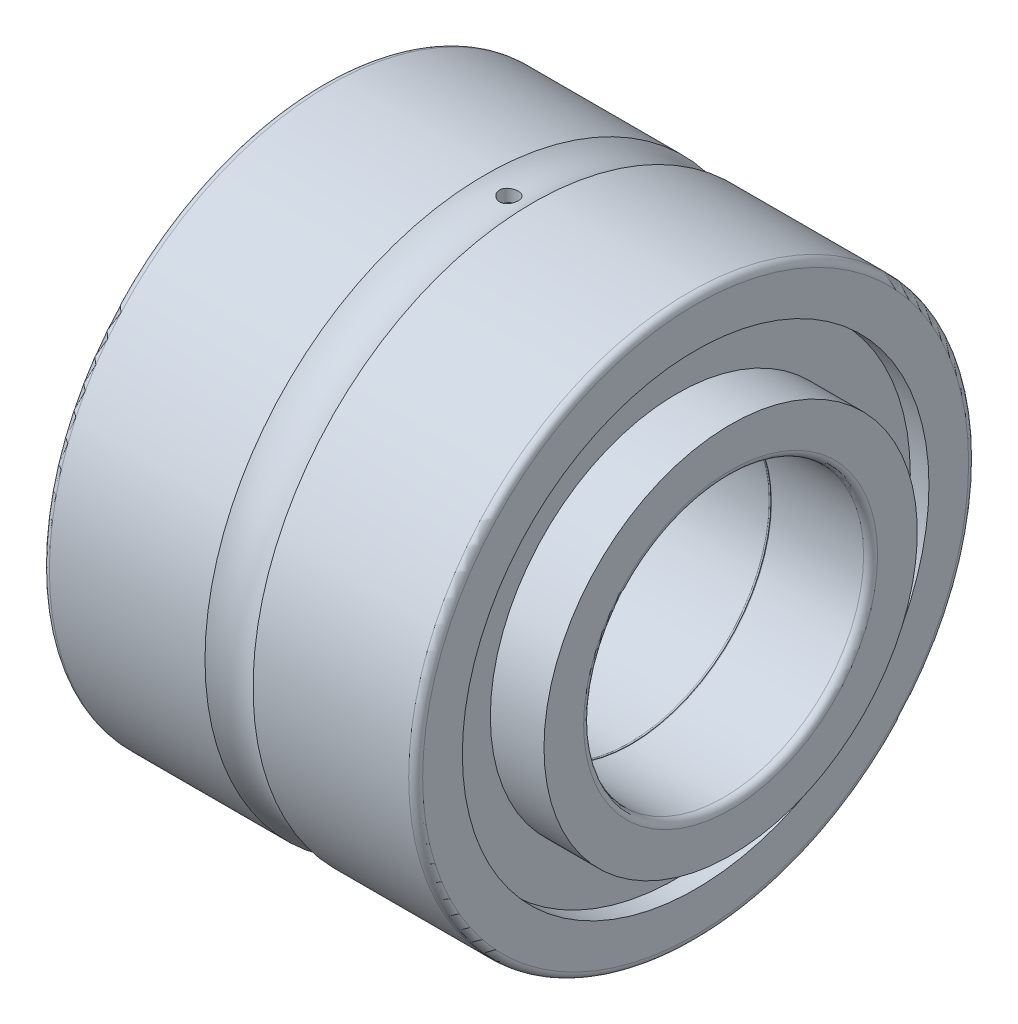
ISO-10303-21;
HEADER;
FILE_DESCRIPTION(('STEP AP214'),'2;1');
FILE_NAME('part.step','',(''),(''),'','','');
FILE_SCHEMA(('AUTOMOTIVE_DESIGN { 1 0 10303 214 1 1 1 1 }'));
ENDSEC;
DATA;
#1=APPLICATION_CONTEXT('core data for automotive mechanical design processes');
#2=APPLICATION_PROTOCOL_DEFINITION('international standard','automotive_design',2000,#1);
#3=PRODUCT_CONTEXT('',#1,'mechanical');
#4=PRODUCT('Part','Part','',(#3));
#5=PRODUCT_RELATED_PRODUCT_CATEGORY('part','',(#4));
#6=PRODUCT_DEFINITION_FORMATION('','',#4);
#7=PRODUCT_DEFINITION_CONTEXT('part definition',#1,'design');
#8=PRODUCT_DEFINITION('design','',#6,#7);
#9=PRODUCT_DEFINITION_SHAPE('','',#8);
#10=(LENGTH_UNIT() NAMED_UNIT(*) SI_UNIT(.MILLI.,.METRE.));
#11=(NAMED_UNIT(*) PLANE_ANGLE_UNIT() SI_UNIT($,.RADIAN.));
#12=(NAMED_UNIT(*) SI_UNIT($,.STERADIAN.) SOLID_ANGLE_UNIT());
#13=UNCERTAINTY_MEASURE_WITH_UNIT(LENGTH_MEASURE(1.E-05),#10,'distance_accuracy_value','');
#14=(GEOMETRIC_REPRESENTATION_CONTEXT(3) GLOBAL_UNCERTAINTY_ASSIGNED_CONTEXT((#13)) GLOBAL_UNIT_ASSIGNED_CONTEXT((#10,
#11,#12)) REPRESENTATION_CONTEXT('',''));
#15=CARTESIAN_POINT('',(0.,0.,0.));
#16=DIRECTION('',(0.,0.,1.));
#17=DIRECTION('',(1.,0.,0.));
#18=AXIS2_PLACEMENT_3D('',#15,#16,#17);
#19=CARTESIAN_POINT('',(13.25,0.,0.));
#20=DIRECTION('',(1.,0.,0.));
#21=DIRECTION('',(0.,0.,-1.));
#22=AXIS2_PLACEMENT_3D('',#19,#20,#21);
#23=TOROIDAL_SURFACE('',#22,6.05,0.0500000000000025);
#24=CARTESIAN_POINT('',(13.1999999999999,0.,0.));
#25=DIRECTION('',(1.,0.,0.));
#26=DIRECTION('',(0.,0.,-1.));
#27=AXIS2_PLACEMENT_3D('',#24,#25,#26);
#28=CIRCLE('',#27,6.05000007699655);
#29=CARTESIAN_POINT('',(13.1999999999999,0.,-6.05000007699655));
#30=VERTEX_POINT('',#29);
#31=EDGE_CURVE('E222',#30,#30,#28,.T.);
#32=ORIENTED_EDGE('',*,*,#31,.F.);
#33=EDGE_LOOP('',(#32));
#34=FACE_BOUND('',#33,.T.);
#35=CARTESIAN_POINT('',(13.25,0.,0.));
#36=DIRECTION('',(-1.,0.,0.));
#37=DIRECTION('',(0.,0.,1.));
#38=AXIS2_PLACEMENT_3D('',#35,#36,#37);
#39=CIRCLE('',#38,6.);
#40=CARTESIAN_POINT('',(13.25,0.,6.));
#41=VERTEX_POINT('',#40);
#42=EDGE_CURVE('E219',#41,#41,#39,.F.);
#43=ORIENTED_EDGE('',*,*,#42,.T.);
#44=EDGE_LOOP('',(#43));
#45=FACE_BOUND('',#44,.T.);
#46=ADVANCED_FACE('F17',(#34,#45),#23,.T.);
#47=CARTESIAN_POINT('',(16.,0.,0.));
#48=DIRECTION('',(-1.,0.,0.));
#49=DIRECTION('',(0.,0.,1.));
#50=AXIS2_PLACEMENT_3D('',#47,#48,#49);
#51=CYLINDRICAL_SURFACE('',#50,6.);
#52=ORIENTED_EDGE('',*,*,#42,.F.);
#53=EDGE_LOOP('',(#52));
#54=FACE_BOUND('',#53,.T.);
#55=CARTESIAN_POINT('',(17.2,0.,0.));
#56=DIRECTION('',(1.,0.,0.));
#57=DIRECTION('',(0.,0.,-1.));
#58=AXIS2_PLACEMENT_3D('',#55,#56,#57);
#59=CIRCLE('',#58,6.);
#60=CARTESIAN_POINT('',(17.2,0.,-6.));
#61=VERTEX_POINT('',#60);
#62=EDGE_CURVE('E227',#61,#61,#59,.F.);
#63=ORIENTED_EDGE('',*,*,#62,.F.);
#64=EDGE_LOOP('',(#63));
#65=FACE_BOUND('',#64,.T.);
#66=ADVANCED_FACE('F238',(#54,#65),#51,.F.);
#67=CARTESIAN_POINT('',(13.15,0.,0.));
#68=DIRECTION('',(1.,0.,0.));
#69=DIRECTION('',(0.,0.,-1.));
#70=AXIS2_PLACEMENT_3D('',#67,#68,#69);
#71=TOROIDAL_SURFACE('',#70,6.05,0.0500000000000014);
#72=CARTESIAN_POINT('',(13.15,0.,0.));
#73=DIRECTION('',(-1.,0.,0.));
#74=DIRECTION('',(0.,0.,1.));
#75=AXIS2_PLACEMENT_3D('',#72,#73,#74);
#76=CIRCLE('',#75,6.);
#77=CARTESIAN_POINT('',(13.15,0.,6.));
#78=VERTEX_POINT('',#77);
#79=EDGE_CURVE('E307',#78,#78,#76,.T.);
#80=ORIENTED_EDGE('',*,*,#79,.T.);
#81=EDGE_LOOP('',(#80));
#82=FACE_BOUND('',#81,.T.);
#83=ORIENTED_EDGE('',*,*,#31,.T.);
#84=EDGE_LOOP('',(#83));
#85=FACE_BOUND('',#84,.T.);
#86=ADVANCED_FACE('F235',(#82,#85),#71,.T.);
#87=CARTESIAN_POINT('',(17.2,0.,0.));
#88=DIRECTION('',(1.,0.,0.));
#89=DIRECTION('',(0.,0.,-1.));
#90=AXIS2_PLACEMENT_3D('',#87,#88,#89);
#91=TOROIDAL_SURFACE('',#90,6.3,0.300000000000001);
#92=ORIENTED_EDGE('',*,*,#62,.T.);
#93=EDGE_LOOP('',(#92));
#94=FACE_BOUND('',#93,.T.);
#95=CARTESIAN_POINT('',(17.5,0.,0.));
#96=DIRECTION('',(1.,0.,0.));
#97=DIRECTION('',(0.,0.,-1.));
#98=AXIS2_PLACEMENT_3D('',#95,#96,#97);
#99=CIRCLE('',#98,6.3);
#100=CARTESIAN_POINT('',(17.5,0.,-6.3));
#101=VERTEX_POINT('',#100);
#102=EDGE_CURVE('E305',#101,#101,#99,.F.);
#103=ORIENTED_EDGE('',*,*,#102,.F.);
#104=EDGE_LOOP('',(#103));
#105=FACE_BOUND('',#104,.T.);
#106=ADVANCED_FACE('F237',(#94,#105),#91,.T.);
#107=CARTESIAN_POINT('',(16.,0.,0.));
#108=DIRECTION('',(-1.,0.,0.));
#109=DIRECTION('',(0.,0.,1.));
#110=AXIS2_PLACEMENT_3D('',#107,#108,#109);
#111=CYLINDRICAL_SURFACE('',#110,6.);
#112=CARTESIAN_POINT('',(0.300000000000002,0.,0.));
#113=DIRECTION('',(1.,0.,0.));
#114=DIRECTION('',(0.,0.,-1.));
#115=AXIS2_PLACEMENT_3D('',#112,#113,#114);
#116=CIRCLE('',#115,6.);
#117=CARTESIAN_POINT('',(0.300000000000002,0.,-6.));
#118=VERTEX_POINT('',#117);
#119=EDGE_CURVE('E45',#118,#118,#116,.T.);
#120=ORIENTED_EDGE('',*,*,#119,.F.);
#121=EDGE_LOOP('',(#120));
#122=FACE_BOUND('',#121,.T.);
#123=ORIENTED_EDGE('',*,*,#79,.F.);
#124=EDGE_LOOP('',(#123));
#125=FACE_BOUND('',#124,.T.);
#126=ADVANCED_FACE('F325',(#122,#125),#111,.F.);
#127=CARTESIAN_POINT('',(17.5,6.3,0.));
#128=DIRECTION('',(1.,0.,0.));
#129=DIRECTION('',(0.,0.,-1.));
#130=AXIS2_PLACEMENT_3D('',#127,#128,#129);
#131=PLANE('',#130);
#132=ORIENTED_EDGE('',*,*,#102,.T.);
#133=EDGE_LOOP('',(#132));
#134=FACE_BOUND('',#133,.T.);
#135=CARTESIAN_POINT('',(17.5,0.,0.));
#136=DIRECTION('',(-1.,0.,0.));
#137=DIRECTION('',(0.,0.,1.));
#138=AXIS2_PLACEMENT_3D('',#135,#136,#137);
#139=CIRCLE('',#138,8.);
#140=CARTESIAN_POINT('',(17.5,0.,8.));
#141=VERTEX_POINT('',#140);
#142=EDGE_CURVE('E21',#141,#141,#139,.T.);
#143=ORIENTED_EDGE('',*,*,#142,.F.);
#144=EDGE_LOOP('',(#143));
#145=FACE_BOUND('',#144,.T.);
#146=ADVANCED_FACE('F70',(#134,#145),#131,.T.);
#147=CARTESIAN_POINT('',(0.300000000000002,0.,0.));
#148=DIRECTION('',(1.,0.,0.));
#149=DIRECTION('',(0.,0.,-1.));
#150=AXIS2_PLACEMENT_3D('',#147,#148,#149);
#151=TOROIDAL_SURFACE('',#150,6.3,0.300000000000002);
#152=CARTESIAN_POINT('',(0.,0.,0.));
#153=DIRECTION('',(-1.,0.,0.));
#154=DIRECTION('',(0.,0.,-1.));
#155=AXIS2_PLACEMENT_3D('',#152,#153,#154);
#156=CIRCLE('',#155,6.3);
#157=CARTESIAN_POINT('',(0.,0.,-6.3));
#158=VERTEX_POINT('',#157);
#159=EDGE_CURVE('E52',#158,#158,#156,.F.);
#160=ORIENTED_EDGE('',*,*,#159,.F.);
#161=EDGE_LOOP('',(#160));
#162=FACE_BOUND('',#161,.T.);
#163=ORIENTED_EDGE('',*,*,#119,.T.);
#164=EDGE_LOOP('',(#163));
#165=FACE_BOUND('',#164,.T.);
#166=ADVANCED_FACE('F59',(#162,#165),#151,.T.);
#167=CARTESIAN_POINT('',(16.,0.,0.));
#168=DIRECTION('',(-1.,0.,0.));
#169=DIRECTION('',(0.,0.,1.));
#170=AXIS2_PLACEMENT_3D('',#167,#168,#169);
#171=CYLINDRICAL_SURFACE('',#170,8.);
#172=ORIENTED_EDGE('',*,*,#142,.T.);
#173=EDGE_LOOP('',(#172));
#174=FACE_BOUND('',#173,.T.);
#175=CARTESIAN_POINT('',(15.2,0.,0.));
#176=DIRECTION('',(-1.,0.,0.));
#177=DIRECTION('',(0.,0.,1.));
#178=AXIS2_PLACEMENT_3D('',#175,#176,#177);
#179=CIRCLE('',#178,8.);
#180=CARTESIAN_POINT('',(15.2,0.,8.));
#181=VERTEX_POINT('',#180);
#182=EDGE_CURVE('E347',#181,#181,#179,.T.);
#183=ORIENTED_EDGE('',*,*,#182,.F.);
#184=EDGE_LOOP('',(#183));
#185=FACE_BOUND('',#184,.T.);
#186=ADVANCED_FACE('F69',(#174,#185),#171,.T.);
#187=CARTESIAN_POINT('',(0.,8.,0.));
#188=DIRECTION('',(-1.,0.,0.));
#189=DIRECTION('',(0.,0.,1.));
#190=AXIS2_PLACEMENT_3D('',#187,#188,#189);
#191=PLANE('',#190);
#192=CARTESIAN_POINT('',(0.,0.,0.));
#193=DIRECTION('',(-1.,0.,0.));
#194=DIRECTION('',(0.,0.,1.));
#195=AXIS2_PLACEMENT_3D('',#192,#193,#194);
#196=CIRCLE('',#195,8.);
#197=CARTESIAN_POINT('',(0.,0.,8.));
#198=VERTEX_POINT('',#197);
#199=EDGE_CURVE('E351',#198,#198,#196,.F.);
#200=ORIENTED_EDGE('',*,*,#199,.F.);
#201=EDGE_LOOP('',(#200));
#202=FACE_BOUND('',#201,.T.);
#203=ORIENTED_EDGE('',*,*,#159,.T.);
#204=EDGE_LOOP('',(#203));
#205=FACE_BOUND('',#204,.T.);
#206=ADVANCED_FACE('F81',(#202,#205),#191,.T.);
#207=CARTESIAN_POINT('',(15.2,8.,0.));
#208=DIRECTION('',(1.,0.,0.));
#209=DIRECTION('',(0.,0.,-1.));
#210=AXIS2_PLACEMENT_3D('',#207,#208,#209);
#211=PLANE('',#210);
#212=ORIENTED_EDGE('',*,*,#182,.T.);
#213=EDGE_LOOP('',(#212));
#214=FACE_BOUND('',#213,.T.);
#215=CARTESIAN_POINT('',(15.2,0.,0.));
#216=DIRECTION('',(-1.,0.,0.));
#217=DIRECTION('',(0.,0.,1.));
#218=AXIS2_PLACEMENT_3D('',#215,#216,#217);
#219=CIRCLE('',#218,10.);
#220=CARTESIAN_POINT('',(15.2,0.,10.));
#221=VERTEX_POINT('',#220);
#222=EDGE_CURVE('E354',#221,#221,#219,.F.);
#223=ORIENTED_EDGE('',*,*,#222,.T.);
#224=EDGE_LOOP('',(#223));
#225=FACE_BOUND('',#224,.T.);
#226=ADVANCED_FACE('F90',(#214,#225),#211,.T.);
#227=CARTESIAN_POINT('',(16.,0.,0.));
#228=DIRECTION('',(-1.,0.,0.));
#229=DIRECTION('',(0.,0.,1.));
#230=AXIS2_PLACEMENT_3D('',#227,#228,#229);
#231=CYLINDRICAL_SURFACE('',#230,8.);
#232=CARTESIAN_POINT('',(0.8,0.,0.));
#233=DIRECTION('',(-1.,0.,0.));
#234=DIRECTION('',(0.,0.,1.));
#235=AXIS2_PLACEMENT_3D('',#232,#233,#234);
#236=CIRCLE('',#235,8.);
#237=CARTESIAN_POINT('',(0.8,0.,8.));
#238=VERTEX_POINT('',#237);
#239=EDGE_CURVE('E200',#238,#238,#236,.F.);
#240=ORIENTED_EDGE('',*,*,#239,.F.);
#241=EDGE_LOOP('',(#240));
#242=FACE_BOUND('',#241,.T.);
#243=ORIENTED_EDGE('',*,*,#199,.T.);
#244=EDGE_LOOP('',(#243));
#245=FACE_BOUND('',#244,.T.);
#246=ADVANCED_FACE('F94',(#242,#245),#231,.T.);
#247=CARTESIAN_POINT('',(16.,0.,0.));
#248=DIRECTION('',(-1.,0.,0.));
#249=DIRECTION('',(0.,0.,1.));
#250=AXIS2_PLACEMENT_3D('',#247,#248,#249);
#251=CYLINDRICAL_SURFACE('',#250,10.);
#252=ORIENTED_EDGE('',*,*,#222,.F.);
#253=EDGE_LOOP('',(#252));
#254=FACE_BOUND('',#253,.T.);
#255=CARTESIAN_POINT('',(16.,0.,0.));
#256=DIRECTION('',(-1.,0.,0.));
#257=DIRECTION('',(0.,0.,1.));
#258=AXIS2_PLACEMENT_3D('',#255,#256,#257);
#259=CIRCLE('',#258,10.);
#260=CARTESIAN_POINT('',(16.,0.,10.));
#261=VERTEX_POINT('',#260);
#262=EDGE_CURVE('E195',#261,#261,#259,.T.);
#263=ORIENTED_EDGE('',*,*,#262,.F.);
#264=EDGE_LOOP('',(#263));
#265=FACE_BOUND('',#264,.T.);
#266=ADVANCED_FACE('F98',(#254,#265),#251,.F.);
#267=CARTESIAN_POINT('',(0.8,10.,0.));
#268=DIRECTION('',(-1.,0.,0.));
#269=DIRECTION('',(0.,0.,1.));
#270=AXIS2_PLACEMENT_3D('',#267,#268,#269);
#271=PLANE('',#270);
#272=CARTESIAN_POINT('',(0.8,0.,0.));
#273=DIRECTION('',(-1.,0.,0.));
#274=DIRECTION('',(0.,0.,1.));
#275=AXIS2_PLACEMENT_3D('',#272,#273,#274);
#276=CIRCLE('',#275,10.);
#277=CARTESIAN_POINT('',(0.8,0.,10.));
#278=VERTEX_POINT('',#277);
#279=EDGE_CURVE('E190',#278,#278,#276,.T.);
#280=ORIENTED_EDGE('',*,*,#279,.T.);
#281=EDGE_LOOP('',(#280));
#282=FACE_BOUND('',#281,.T.);
#283=ORIENTED_EDGE('',*,*,#239,.T.);
#284=EDGE_LOOP('',(#283));
#285=FACE_BOUND('',#284,.T.);
#286=ADVANCED_FACE('F102',(#282,#285),#271,.T.);
#287=CARTESIAN_POINT('',(16.,10.,0.));
#288=DIRECTION('',(1.,0.,0.));
#289=DIRECTION('',(0.,0.,-1.));
#290=AXIS2_PLACEMENT_3D('',#287,#288,#289);
#291=PLANE('',#290);
#292=ORIENTED_EDGE('',*,*,#262,.T.);
#293=EDGE_LOOP('',(#292));
#294=FACE_BOUND('',#293,.T.);
#295=CARTESIAN_POINT('',(16.,0.,0.));
#296=DIRECTION('',(-1.,0.,0.));
#297=DIRECTION('',(0.,0.,-1.));
#298=AXIS2_PLACEMENT_3D('',#295,#296,#297);
#299=CIRCLE('',#298,11.7);
#300=CARTESIAN_POINT('',(16.,0.,-11.7));
#301=VERTEX_POINT('',#300);
#302=EDGE_CURVE('E128',#301,#301,#299,.T.);
#303=ORIENTED_EDGE('',*,*,#302,.F.);
#304=EDGE_LOOP('',(#303));
#305=FACE_BOUND('',#304,.T.);
#306=ADVANCED_FACE('F106',(#294,#305),#291,.T.);
#307=CARTESIAN_POINT('',(16.,0.,0.));
#308=DIRECTION('',(-1.,0.,0.));
#309=DIRECTION('',(0.,0.,1.));
#310=AXIS2_PLACEMENT_3D('',#307,#308,#309);
#311=CYLINDRICAL_SURFACE('',#310,10.);
#312=CARTESIAN_POINT('',(0.,0.,0.));
#313=DIRECTION('',(-1.,0.,0.));
#314=DIRECTION('',(0.,0.,1.));
#315=AXIS2_PLACEMENT_3D('',#312,#313,#314);
#316=CIRCLE('',#315,10.);
#317=CARTESIAN_POINT('',(0.,0.,10.));
#318=VERTEX_POINT('',#317);
#319=EDGE_CURVE('E180',#318,#318,#316,.F.);
#320=ORIENTED_EDGE('',*,*,#319,.F.);
#321=EDGE_LOOP('',(#320));
#322=FACE_BOUND('',#321,.T.);
#323=ORIENTED_EDGE('',*,*,#279,.F.);
#324=EDGE_LOOP('',(#323));
#325=FACE_BOUND('',#324,.T.);
#326=ADVANCED_FACE('F111',(#322,#325),#311,.F.);
#327=CARTESIAN_POINT('',(15.7,0.,0.));
#328=DIRECTION('',(1.,0.,0.));
#329=DIRECTION('',(0.,0.,-1.));
#330=AXIS2_PLACEMENT_3D('',#327,#328,#329);
#331=TOROIDAL_SURFACE('',#330,11.7,0.299999999999998);
#332=ORIENTED_EDGE('',*,*,#302,.T.);
#333=EDGE_LOOP('',(#332));
#334=FACE_BOUND('',#333,.T.);
#335=CARTESIAN_POINT('',(15.7,0.,0.));
#336=DIRECTION('',(-1.,0.,0.));
#337=DIRECTION('',(0.,0.,1.));
#338=AXIS2_PLACEMENT_3D('',#335,#336,#337);
#339=CIRCLE('',#338,12.);
#340=CARTESIAN_POINT('',(15.7,0.,12.));
#341=VERTEX_POINT('',#340);
#342=EDGE_CURVE('E176',#341,#341,#339,.T.);
#343=ORIENTED_EDGE('',*,*,#342,.F.);
#344=EDGE_LOOP('',(#343));
#345=FACE_BOUND('',#344,.T.);
#346=ADVANCED_FACE('F132',(#334,#345),#331,.T.);
#347=CARTESIAN_POINT('',(8.,11.2,0.));
#348=DIRECTION('',(0.,1.,0.));
#349=DIRECTION('',(0.,0.,1.));
#350=AXIS2_PLACEMENT_3D('',#347,#348,#349);
#351=PLANE('',#350);
#352=CARTESIAN_POINT('',(8.,11.2,0.));
#353=DIRECTION('',(0.,1.,0.));
#354=DIRECTION('',(0.,0.,1.));
#355=AXIS2_PLACEMENT_3D('',#352,#353,#354);
#356=CIRCLE('',#355,0.4);
#357=CARTESIAN_POINT('',(8.,11.2,0.4));
#358=VERTEX_POINT('',#357);
#359=EDGE_CURVE('E179',#358,#358,#356,.T.);
#360=ORIENTED_EDGE('',*,*,#359,.T.);
#361=EDGE_LOOP('',(#360));
#362=FACE_BOUND('',#361,.T.);
#363=ADVANCED_FACE('F141',(#362),#351,.T.);
#364=CARTESIAN_POINT('',(0.,11.7,0.));
#365=DIRECTION('',(-1.,0.,0.));
#366=DIRECTION('',(0.,0.,1.));
#367=AXIS2_PLACEMENT_3D('',#364,#365,#366);
#368=PLANE('',#367);
#369=CARTESIAN_POINT('',(0.,0.,0.));
#370=DIRECTION('',(1.,0.,0.));
#371=DIRECTION('',(0.,0.,-1.));
#372=AXIS2_PLACEMENT_3D('',#369,#370,#371);
#373=CIRCLE('',#372,11.7);
#374=CARTESIAN_POINT('',(0.,0.,-11.7));
#375=VERTEX_POINT('',#374);
#376=EDGE_CURVE('E207',#375,#375,#373,.T.);
#377=ORIENTED_EDGE('',*,*,#376,.F.);
#378=EDGE_LOOP('',(#377));
#379=FACE_BOUND('',#378,.T.);
#380=ORIENTED_EDGE('',*,*,#319,.T.);
#381=EDGE_LOOP('',(#380));
#382=FACE_BOUND('',#381,.T.);
#383=ADVANCED_FACE('F276',(#379,#382),#368,.T.);
#384=CARTESIAN_POINT('',(16.,0.,0.));
#385=DIRECTION('',(-1.,0.,0.));
#386=DIRECTION('',(0.,0.,1.));
#387=AXIS2_PLACEMENT_3D('',#384,#385,#386);
#388=CYLINDRICAL_SURFACE('',#387,12.);
#389=ORIENTED_EDGE('',*,*,#342,.T.);
#390=EDGE_LOOP('',(#389));
#391=FACE_BOUND('',#390,.T.);
#392=CARTESIAN_POINT('',(9.03015750727543,0.,0.));
#393=DIRECTION('',(1.,0.,0.));
#394=DIRECTION('',(0.,0.,-1.));
#395=AXIS2_PLACEMENT_3D('',#392,#393,#394);
#396=CIRCLE('',#395,12.);
#397=CARTESIAN_POINT('',(9.03015750727543,0.,-12.));
#398=VERTEX_POINT('',#397);
#399=EDGE_CURVE('E214',#398,#398,#396,.T.);
#400=ORIENTED_EDGE('',*,*,#399,.T.);
#401=EDGE_LOOP('',(#400));
#402=FACE_BOUND('',#401,.T.);
#403=ADVANCED_FACE('F273',(#391,#402),#388,.T.);
#404=CARTESIAN_POINT('',(8.,12.8,0.));
#405=DIRECTION('',(0.,1.,0.));
#406=DIRECTION('',(0.,0.,1.));
#407=AXIS2_PLACEMENT_3D('',#404,#405,#406);
#408=CYLINDRICAL_SURFACE('',#407,0.4);
#409=CARTESIAN_POINT('',(7.66892002581595,11.7397337905121,-0.224468373483462));
#410=CARTESIAN_POINT('',(7.65648577273831,11.7421710885257,-0.206141900952733));
#411=CARTESIAN_POINT('',(7.64559662641556,11.7444461088603,-0.186793891162923));
#412=CARTESIAN_POINT('',(7.62713253494215,11.7484323656313,-0.14648845970038));
#413=CARTESIAN_POINT('',(7.61955885815429,11.7501433862428,-0.125530425696187));
#414=CARTESIAN_POINT('',(7.60798620633393,11.7528011004349,-0.0825882281282738));
#415=CARTESIAN_POINT('',(7.60398999898482,11.7537472021868,-0.0606032839134167));
#416=CARTESIAN_POINT('',(7.59971068618412,11.754761414623,-0.0162563371002613));
#417=CARTESIAN_POINT('',(7.59942690863818,11.754829684229,0.00610559651426446));
#418=CARTESIAN_POINT('',(7.60255665924619,11.7540863673193,0.0501962013898469));
#419=CARTESIAN_POINT('',(7.60591177701535,11.7532886806689,0.0719292944871304));
#420=CARTESIAN_POINT('',(7.61612406626922,11.7509258871836,0.114542611911845));
#421=CARTESIAN_POINT('',(7.6229860394465,11.7493597282508,0.135421624359761));
#422=CARTESIAN_POINT('',(7.64004693829973,11.7456262552477,0.175833289074018));
#423=CARTESIAN_POINT('',(7.65026251569781,11.7434559497436,0.195358621614911));
#424=CARTESIAN_POINT('',(7.67373028760577,11.7387559612293,0.232443049805988));
#425=CARTESIAN_POINT('',(7.68698297784051,11.7362262195767,0.250001823772456));
#426=CARTESIAN_POINT('',(7.7165456490912,11.7310125293468,0.283123120021863));
#427=CARTESIAN_POINT('',(7.73292457393255,11.7283262977507,0.298623804496956));
#428=CARTESIAN_POINT('',(7.76804589416591,11.7231617894789,0.326651756547192));
#429=CARTESIAN_POINT('',(7.78678496280034,11.7206832281132,0.339183139249907));
#430=CARTESIAN_POINT('',(7.82627981064152,11.7161897668332,0.36101765465596));
#431=CARTESIAN_POINT('',(7.84704835298365,11.7141781107295,0.37029841773983));
#432=CARTESIAN_POINT('',(7.88990780266155,11.710871155247,0.385219905009558));
#433=CARTESIAN_POINT('',(7.91199849658699,11.7095757406024,0.390861214922367));
#434=CARTESIAN_POINT('',(7.95637157296409,11.7078707394802,0.398235607064081));
#435=CARTESIAN_POINT('',(7.97863984566213,11.7074428693082,0.400049389580738));
#436=CARTESIAN_POINT('',(8.02316617233301,11.7074665166148,0.399948571864995));
#437=CARTESIAN_POINT('',(8.04542422708113,11.7079179497494,0.39803432923001));
#438=CARTESIAN_POINT('',(8.08892795071045,11.7096346182392,0.390603492799029));
#439=CARTESIAN_POINT('',(8.11018411809871,11.710886721619,0.385145007085895));
#440=CARTESIAN_POINT('',(8.15150409288117,11.7140582043927,0.370843935559206));
#441=CARTESIAN_POINT('',(8.17156617887492,11.7159785210506,0.361996594629466));
#442=CARTESIAN_POINT('',(8.21019247045617,11.7203096347803,0.341039973780373));
#443=CARTESIAN_POINT('',(8.22873361183339,11.7227265274091,0.328889482066645));
#444=CARTESIAN_POINT('',(8.2635433115012,11.7277752995108,0.301716124306787));
#445=CARTESIAN_POINT('',(8.2798115791284,11.7304072064124,0.286692891464884));
#446=CARTESIAN_POINT('',(8.3100033768857,11.7356649425387,0.253787056754372));
#447=CARTESIAN_POINT('',(8.32386386353011,11.7382892187379,0.235846280857591));
#448=CARTESIAN_POINT('',(8.34836069675696,11.7431672575866,0.197874991131509));
#449=CARTESIAN_POINT('',(8.35900174910097,11.7454215587901,0.177847585445791));
#450=CARTESIAN_POINT('',(8.37674682543048,11.7492980132403,0.136276654573213));
#451=CARTESIAN_POINT('',(8.38385878928139,11.750921583722,0.114736658353184));
#452=CARTESIAN_POINT('',(8.39434748168283,11.753349014573,0.0707222317265701));
#453=CARTESIAN_POINT('',(8.39772490365877,11.7541530271148,0.0482479755966655));
#454=CARTESIAN_POINT('',(8.40059386608366,11.7548348570376,0.00359259181467242));
#455=CARTESIAN_POINT('',(8.40017843455318,11.7547348481283,-0.0185822595923069));
#456=CARTESIAN_POINT('',(8.39569813915094,11.7536736002575,-0.0625378946945916));
#457=CARTESIAN_POINT('',(8.39163340861123,11.752712392761,-0.0843186927575058));
#458=CARTESIAN_POINT('',(8.38003632361015,11.7500518318781,-0.126692811666178));
#459=CARTESIAN_POINT('',(8.37253272715718,11.7483586066235,-0.147294417067869));
#460=CARTESIAN_POINT('',(8.35428120734587,11.744421265209,-0.186983171083058));
#461=CARTESIAN_POINT('',(8.3435285638073,11.7421763484494,-0.206068064940293));
#462=CARTESIAN_POINT('',(8.31883082199768,11.7373303393831,-0.242574601283564));
#463=CARTESIAN_POINT('',(8.30482505176616,11.7347229133504,-0.259954352711029));
#464=CARTESIAN_POINT('',(8.27412637377486,11.7294739413886,-0.292146405191253));
#465=CARTESIAN_POINT('',(8.25743328275093,11.7268323931438,-0.30695853099942));
#466=CARTESIAN_POINT('',(8.22146921036829,11.7217561433895,-0.333863253877197));
#467=CARTESIAN_POINT('',(8.20215700368361,11.7193260564672,-0.34590171822383));
#468=CARTESIAN_POINT('',(8.1617523778611,11.7150064006352,-0.366537727233356));
#469=CARTESIAN_POINT('',(8.14066263906991,11.713116036115,-0.375140344261217));
#470=CARTESIAN_POINT('',(8.09753740195305,11.7101069150165,-0.388574795745849));
#471=CARTESIAN_POINT('',(8.07551615968147,11.7089792364718,-0.393450321235343));
#472=CARTESIAN_POINT('',(8.030942530097,11.707589428796,-0.399434630962801));
#473=CARTESIAN_POINT('',(8.00839023524428,11.7073271500981,-0.400544066093108));
#474=CARTESIAN_POINT('',(7.96395106968448,11.7076937383727,-0.398977832701203));
#475=CARTESIAN_POINT('',(7.94206089865755,11.7083020743039,-0.396389371377038));
#476=CARTESIAN_POINT('',(7.89900749650996,11.7103066356251,-0.387664674410403));
#477=CARTESIAN_POINT('',(7.87784532078537,11.7117039576561,-0.381523500428871));
#478=CARTESIAN_POINT('',(7.83684085211127,11.7151368388733,-0.365869314113367));
#479=CARTESIAN_POINT('',(7.81699960888599,11.7171728984852,-0.356353657240387));
#480=CARTESIAN_POINT('',(7.77916375178451,11.7216648261541,-0.334237376535231));
#481=CARTESIAN_POINT('',(7.76117155133706,11.7241212319954,-0.321632791738106));
#482=CARTESIAN_POINT('',(7.7154885459606,11.7310092177445,-0.283635155776145));
#483=CARTESIAN_POINT('',(7.68998669747573,11.7356044104304,-0.25551790875322));
#484=CARTESIAN_POINT('',(7.66892002581595,11.7397337905121,-0.224468373483462));
#485=B_SPLINE_CURVE_WITH_KNOTS('',3,(#409,#410,#411,#412,#413,#414,#415,#416,#417,#418,#419,
#420,#421,#422,#423,#424,#425,#426,#427,#428,#429,#430,#431,#432,#433,#434,#435,#436,#437,#438,
#439,#440,#441,#442,#443,#444,#445,#446,#447,#448,#449,#450,#451,#452,#453,#454,#455,#456,#457,
#458,#459,#460,#461,#462,#463,#464,#465,#466,#467,#468,#469,#470,#471,#472,#473,#474,#475,#476,
#477,#478,#479,#480,#481,#482,#483,#484),.UNSPECIFIED.,.T.,.F.,(4,2,2,2,2,2,2,2,2,2,2,2,2,2,2,2,
2,2,2,2,2,2,2,2,2,2,2,2,2,2,2,2,2,2,2,2,2,4),(0.,0.066695123968207,0.133415740508096,
0.200187930474481,0.266948031907241,0.332652168990567,0.398446512166785,0.464572615611562,
0.5307095200152,0.598521830044047,0.666239602633396,0.73441462906206,0.802578680787519,
0.869290569784038,0.935996059997512,1.00163461890668,1.06736561881723,1.13395766631823,
1.20055822207309,1.26870153260546,1.3367447532397,1.40463418582853,1.47251101066845,
1.53872756761367,1.60494170534639,1.67061194705722,1.73637805626773,1.80348628858354,
1.87059909934267,1.93892781970082,2.00715528969003,2.07457014607471,2.14197335057529,
2.20781298242279,2.27374435327914,2.33972750830821,2.40579572107886,2.51879360435942),.UNSPECIFIED.);
#486=CARTESIAN_POINT('',(7.66892002581595,11.7397337905121,-0.224468373483462));
#487=VERTEX_POINT('',#486);
#488=EDGE_CURVE('E31',#487,#487,#485,.T.);
#489=ORIENTED_EDGE('',*,*,#488,.T.);
#490=EDGE_LOOP('',(#489));
#491=FACE_BOUND('',#490,.T.);
#492=ORIENTED_EDGE('',*,*,#359,.F.);
#493=EDGE_LOOP('',(#492));
#494=FACE_BOUND('',#493,.T.);
#495=ADVANCED_FACE('F164',(#491,#494),#408,.F.);
#496=CARTESIAN_POINT('',(0.300000000000003,0.,0.));
#497=DIRECTION('',(1.,0.,0.));
#498=DIRECTION('',(0.,0.,-1.));
#499=AXIS2_PLACEMENT_3D('',#496,#497,#498);
#500=TOROIDAL_SURFACE('',#499,11.7,0.300000000000002);
#501=CARTESIAN_POINT('',(0.300000000000002,0.,0.));
#502=DIRECTION('',(-1.,0.,0.));
#503=DIRECTION('',(0.,0.,1.));
#504=AXIS2_PLACEMENT_3D('',#501,#502,#503);
#505=CIRCLE('',#504,12.);
#506=CARTESIAN_POINT('',(0.300000000000002,0.,12.));
#507=VERTEX_POINT('',#506);
#508=EDGE_CURVE('E26',#507,#507,#505,.F.);
#509=ORIENTED_EDGE('',*,*,#508,.F.);
#510=EDGE_LOOP('',(#509));
#511=FACE_BOUND('',#510,.T.);
#512=ORIENTED_EDGE('',*,*,#376,.T.);
#513=EDGE_LOOP('',(#512));
#514=FACE_BOUND('',#513,.T.);
#515=ADVANCED_FACE('F152',(#511,#514),#500,.T.);
#516=CARTESIAN_POINT('',(8.,0.,0.));
#517=DIRECTION('',(1.,0.,0.));
#518=DIRECTION('',(0.,0.,-1.));
#519=AXIS2_PLACEMENT_3D('',#516,#517,#518);
#520=TOROIDAL_SURFACE('',#519,13.7142857142857,2.);
#521=CARTESIAN_POINT('',(6.96984249272458,0.,0.));
#522=DIRECTION('',(-1.,0.,0.));
#523=DIRECTION('',(0.,0.,1.));
#524=AXIS2_PLACEMENT_3D('',#521,#522,#523);
#525=CIRCLE('',#524,12.);
#526=CARTESIAN_POINT('',(6.96984249272458,0.,12.));
#527=VERTEX_POINT('',#526);
#528=EDGE_CURVE('E11',#527,#527,#525,.T.);
#529=ORIENTED_EDGE('',*,*,#528,.F.);
#530=EDGE_LOOP('',(#529));
#531=FACE_BOUND('',#530,.T.);
#532=ORIENTED_EDGE('',*,*,#488,.F.);
#533=EDGE_LOOP('',(#532));
#534=FACE_BOUND('',#533,.T.);
#535=ORIENTED_EDGE('',*,*,#399,.F.);
#536=EDGE_LOOP('',(#535));
#537=FACE_BOUND('',#536,.T.);
#538=ADVANCED_FACE('F163',(#531,#534,#537),#520,.F.);
#539=CARTESIAN_POINT('',(16.,0.,0.));
#540=DIRECTION('',(-1.,0.,0.));
#541=DIRECTION('',(0.,0.,1.));
#542=AXIS2_PLACEMENT_3D('',#539,#540,#541);
#543=CYLINDRICAL_SURFACE('',#542,12.);
#544=ORIENTED_EDGE('',*,*,#528,.T.);
#545=EDGE_LOOP('',(#544));
#546=FACE_BOUND('',#545,.T.);
#547=ORIENTED_EDGE('',*,*,#508,.T.);
#548=EDGE_LOOP('',(#547));
#549=FACE_BOUND('',#548,.T.);
#550=ADVANCED_FACE('F253',(#546,#549),#543,.T.);
#551=CLOSED_SHELL('',(#46,#66,#86,#106,#126,#146,#166,#186,#206,#226,#246,#266,#286,#306,#326,
#346,#363,#383,#403,#495,#515,#538,#550));
#552=MANIFOLD_SOLID_BREP('B1',#551);
#553=ADVANCED_BREP_SHAPE_REPRESENTATION('',(#18,#552),#14);
#554=SHAPE_DEFINITION_REPRESENTATION(#9,#553);
ENDSEC;
END-ISO-10303-21;
